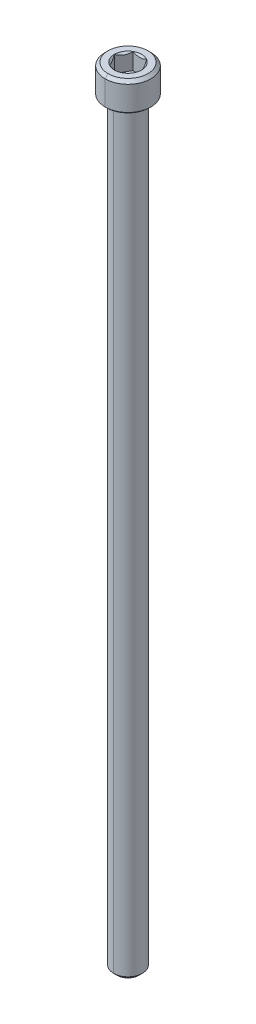
ISO-10303-21;
HEADER;
FILE_DESCRIPTION(('STEP AP214'),'2;1');
FILE_NAME('part.step','',(''),(''),'','','');
FILE_SCHEMA(('AUTOMOTIVE_DESIGN { 1 0 10303 214 1 1 1 1 }'));
ENDSEC;
DATA;
#1=APPLICATION_CONTEXT('core data for automotive mechanical design processes');
#2=APPLICATION_PROTOCOL_DEFINITION('international standard','automotive_design',2000,#1);
#3=PRODUCT_CONTEXT('',#1,'mechanical');
#4=PRODUCT('Part','Part','',(#3));
#5=PRODUCT_RELATED_PRODUCT_CATEGORY('part','',(#4));
#6=PRODUCT_DEFINITION_FORMATION('','',#4);
#7=PRODUCT_DEFINITION_CONTEXT('part definition',#1,'design');
#8=PRODUCT_DEFINITION('design','',#6,#7);
#9=PRODUCT_DEFINITION_SHAPE('','',#8);
#10=(LENGTH_UNIT() NAMED_UNIT(*) SI_UNIT(.MILLI.,.METRE.));
#11=(NAMED_UNIT(*) PLANE_ANGLE_UNIT() SI_UNIT($,.RADIAN.));
#12=(NAMED_UNIT(*) SI_UNIT($,.STERADIAN.) SOLID_ANGLE_UNIT());
#13=UNCERTAINTY_MEASURE_WITH_UNIT(LENGTH_MEASURE(1.E-05),#10,'distance_accuracy_value','');
#14=(GEOMETRIC_REPRESENTATION_CONTEXT(3) GLOBAL_UNCERTAINTY_ASSIGNED_CONTEXT((#13)) GLOBAL_UNIT_ASSIGNED_CONTEXT((#10,
#11,#12)) REPRESENTATION_CONTEXT('',''));
#15=CARTESIAN_POINT('',(0.,0.,0.));
#16=DIRECTION('',(0.,0.,1.));
#17=DIRECTION('',(1.,0.,0.));
#18=AXIS2_PLACEMENT_3D('',#15,#16,#17);
#19=CARTESIAN_POINT('',(0.,-0.152399999999997,0.));
#20=DIRECTION('',(0.,1.,0.));
#21=DIRECTION('',(0.,0.,1.));
#22=AXIS2_PLACEMENT_3D('',#19,#20,#21);
#23=TOROIDAL_SURFACE('',#22,2.5654,0.1524);
#24=CARTESIAN_POINT('',(0.,-0.152399999999997,-2.5654));
#25=DIRECTION('',(1.,0.,0.));
#26=DIRECTION('',(0.,0.,-1.));
#27=AXIS2_PLACEMENT_3D('',#24,#25,#26);
#28=CIRCLE('',#27,0.1524);
#29=CARTESIAN_POINT('',(0.,0.,-2.5654));
#30=VERTEX_POINT('',#29);
#31=CARTESIAN_POINT('',(0.,-0.152399999999997,-2.413));
#32=VERTEX_POINT('',#31);
#33=EDGE_CURVE('E559',#30,#32,#28,.T.);
#34=ORIENTED_EDGE('',*,*,#33,.F.);
#35=CARTESIAN_POINT('',(0.,0.,0.));
#36=DIRECTION('',(0.,1.,0.));
#37=DIRECTION('',(0.,0.,1.));
#38=AXIS2_PLACEMENT_3D('',#35,#36,#37);
#39=CIRCLE('',#38,2.5654);
#40=CARTESIAN_POINT('',(0.,0.,2.5654));
#41=VERTEX_POINT('',#40);
#42=EDGE_CURVE('E481',#41,#30,#39,.T.);
#43=ORIENTED_EDGE('',*,*,#42,.F.);
#44=CARTESIAN_POINT('',(0.,-0.152399999999997,2.5654));
#45=DIRECTION('',(-1.,0.,0.));
#46=DIRECTION('',(0.,0.,1.));
#47=AXIS2_PLACEMENT_3D('',#44,#45,#46);
#48=CIRCLE('',#47,0.1524);
#49=CARTESIAN_POINT('',(0.,-0.152399999999997,2.413));
#50=VERTEX_POINT('',#49);
#51=EDGE_CURVE('E570',#41,#50,#48,.T.);
#52=ORIENTED_EDGE('',*,*,#51,.T.);
#53=CARTESIAN_POINT('',(0.,-0.152399999999997,0.));
#54=DIRECTION('',(0.,-1.,0.));
#55=DIRECTION('',(0.,0.,1.));
#56=AXIS2_PLACEMENT_3D('',#53,#54,#55);
#57=CIRCLE('',#56,2.413);
#58=EDGE_CURVE('E231',#32,#50,#57,.T.);
#59=ORIENTED_EDGE('',*,*,#58,.F.);
#60=EDGE_LOOP('',(#34,#43,#52,#59));
#61=FACE_BOUND('',#60,.T.);
#62=ADVANCED_FACE('F16',(#61),#23,.F.);
#63=CARTESIAN_POINT('',(2.28769270663697,2.032,0.));
#64=DIRECTION('',(0.866025403784439,0.,-0.5));
#65=DIRECTION('',(0.,-1.,0.));
#66=AXIS2_PLACEMENT_3D('',#63,#64,#65);
#67=PLANE('',#66);
#68=DIRECTION('',(0.,1.,0.));
#69=VECTOR('',#68,1.);
#70=CARTESIAN_POINT('',(2.28769270663697,2.032,0.));
#71=LINE('',#70,#69);
#72=CARTESIAN_POINT('',(2.28769270663697,2.032,0.));
#73=VERTEX_POINT('',#72);
#74=CARTESIAN_POINT('',(2.28769270663697,4.826,0.));
#75=VERTEX_POINT('',#74);
#76=EDGE_CURVE('E11',#73,#75,#71,.T.);
#77=ORIENTED_EDGE('',*,*,#76,.T.);
#78=CARTESIAN_POINT('',(2.28769270663697,4.826,0.));
#79=CARTESIAN_POINT('',(2.14317957440595,4.68148686776898,-0.250304087385059));
#80=CARTESIAN_POINT('',(2.01227876614631,4.6063557329633,-0.477030938042588));
#81=CARTESIAN_POINT('',(1.86218187125153,4.52020691391333,-0.737006386058674));
#82=CARTESIAN_POINT('',(1.71787595811445,4.51951177250135,-0.986951559444716));
#83=CARTESIAN_POINT('',(1.5738329827954,4.51881789769698,-1.23644131117069));
#84=CARTESIAN_POINT('',(1.42308868167617,4.6041731544126,-1.49753809966066));
#85=CARTESIAN_POINT('',(1.29072619033411,4.67912016298365,-1.7267966596815));
#86=CARTESIAN_POINT('',(1.14384635331849,4.826,-1.9812));
#87=B_SPLINE_CURVE_WITH_KNOTS('',2,(#78,#79,#80,#81,#82,#83,#84,#85,#86),.UNSPECIFIED.,.F.,.F.,
(3,2,2,2,3),(0.,0.25,0.5,0.75,1.),.UNSPECIFIED.);
#88=CARTESIAN_POINT('',(1.14384635331849,4.826,-1.9812));
#89=VERTEX_POINT('',#88);
#90=EDGE_CURVE('E199',#75,#89,#87,.T.);
#91=ORIENTED_EDGE('',*,*,#90,.T.);
#92=DIRECTION('',(0.,1.,0.));
#93=VECTOR('',#92,1.);
#94=CARTESIAN_POINT('',(1.14384635331849,2.032,-1.9812));
#95=LINE('',#94,#93);
#96=CARTESIAN_POINT('',(1.14384635331849,2.032,-1.9812));
#97=VERTEX_POINT('',#96);
#98=EDGE_CURVE('E170',#97,#89,#95,.T.);
#99=ORIENTED_EDGE('',*,*,#98,.F.);
#100=DIRECTION('',(-0.5,0.,-0.866025403784439));
#101=VECTOR('',#100,1.);
#102=CARTESIAN_POINT('',(2.28769270663697,2.032,0.));
#103=LINE('',#102,#101);
#104=EDGE_CURVE('E191',#73,#97,#103,.T.);
#105=ORIENTED_EDGE('',*,*,#104,.F.);
#106=EDGE_LOOP('',(#77,#91,#99,#105));
#107=FACE_BOUND('',#106,.T.);
#108=ADVANCED_FACE('F196',(#107),#67,.F.);
#109=CARTESIAN_POINT('',(1.14384635331849,2.032,1.9812));
#110=DIRECTION('',(0.866025403784439,0.,0.5));
#111=DIRECTION('',(0.,-1.,0.));
#112=AXIS2_PLACEMENT_3D('',#109,#110,#111);
#113=PLANE('',#112);
#114=DIRECTION('',(0.,1.,0.));
#115=VECTOR('',#114,1.);
#116=CARTESIAN_POINT('',(1.14384635331849,2.032,1.9812));
#117=LINE('',#116,#115);
#118=CARTESIAN_POINT('',(1.14384635331849,2.032,1.9812));
#119=VERTEX_POINT('',#118);
#120=CARTESIAN_POINT('',(1.14384635331849,4.826,1.9812));
#121=VERTEX_POINT('',#120);
#122=EDGE_CURVE('E30',#119,#121,#117,.T.);
#123=ORIENTED_EDGE('',*,*,#122,.T.);
#124=CARTESIAN_POINT('',(1.14384635331849,4.826,1.9812));
#125=CARTESIAN_POINT('',(1.28835948554838,4.6814868677701,1.7308959126169));
#126=CARTESIAN_POINT('',(1.41926029380915,4.60635573296329,1.50416906195741));
#127=CARTESIAN_POINT('',(1.56935718870215,4.5202069139138,1.24419361394442));
#128=CARTESIAN_POINT('',(1.71366310184101,4.51951177250135,0.994248440555283));
#129=CARTESIAN_POINT('',(1.85770607715928,4.51881789769651,0.744758688830662));
#130=CARTESIAN_POINT('',(2.00845037827929,4.6041731544126,0.48366190033934));
#131=CARTESIAN_POINT('',(2.14081286962138,4.67912016298368,0.254403340318435));
#132=CARTESIAN_POINT('',(2.28769270663697,4.826,0.));
#133=B_SPLINE_CURVE_WITH_KNOTS('',2,(#124,#125,#126,#127,#128,#129,#130,#131,#132),
.UNSPECIFIED.,.F.,.F.,(3,2,2,2,3),(0.,0.25,0.5,0.75,1.),.UNSPECIFIED.);
#134=EDGE_CURVE('E183',#121,#75,#133,.T.);
#135=ORIENTED_EDGE('',*,*,#134,.T.);
#136=ORIENTED_EDGE('',*,*,#76,.F.);
#137=DIRECTION('',(0.5,0.,-0.866025403784439));
#138=VECTOR('',#137,1.);
#139=CARTESIAN_POINT('',(1.14384635331849,2.032,1.9812));
#140=LINE('',#139,#138);
#141=EDGE_CURVE('E180',#119,#73,#140,.T.);
#142=ORIENTED_EDGE('',*,*,#141,.F.);
#143=EDGE_LOOP('',(#123,#135,#136,#142));
#144=FACE_BOUND('',#143,.T.);
#145=ADVANCED_FACE('F179',(#144),#113,.F.);
#146=CARTESIAN_POINT('',(-1.14384635331848,2.032,1.9812));
#147=DIRECTION('',(0.,0.,1.));
#148=DIRECTION('',(1.,0.,0.));
#149=AXIS2_PLACEMENT_3D('',#146,#147,#148);
#150=PLANE('',#149);
#151=DIRECTION('',(0.,1.,0.));
#152=VECTOR('',#151,1.);
#153=CARTESIAN_POINT('',(-1.14384635331848,2.032,1.9812));
#154=LINE('',#153,#152);
#155=CARTESIAN_POINT('',(-1.14384635331848,2.032,1.9812));
#156=VERTEX_POINT('',#155);
#157=CARTESIAN_POINT('',(-1.14384635331848,4.826,1.9812));
#158=VERTEX_POINT('',#157);
#159=EDGE_CURVE('E413',#156,#158,#154,.T.);
#160=ORIENTED_EDGE('',*,*,#159,.T.);
#161=CARTESIAN_POINT('',(-1.14384635331848,4.826,1.9812));
#162=CARTESIAN_POINT('',(-0.852604529161856,4.68037908792168,1.9812));
#163=CARTESIAN_POINT('',(-0.58892975472875,4.6051869937822,1.9812));
#164=CARTESIAN_POINT('',(-0.288478278545423,4.51950729336303,1.9812));
#165=CARTESIAN_POINT('',(0.,4.51950729336303,1.9812));
#166=B_SPLINE_CURVE_WITH_KNOTS('',2,(#161,#162,#163,#164,#165),.UNSPECIFIED.,.F.,.F.,(3,2,3),
(0.,0.5,1.),.UNSPECIFIED.);
#167=CARTESIAN_POINT('',(0.,4.51950729336303,1.9812));
#168=VERTEX_POINT('',#167);
#169=EDGE_CURVE('E408',#158,#168,#166,.T.);
#170=ORIENTED_EDGE('',*,*,#169,.T.);
#171=CARTESIAN_POINT('',(0.,4.51950729336303,1.9812));
#172=CARTESIAN_POINT('',(0.287946815411568,4.51950729336303,1.9812));
#173=CARTESIAN_POINT('',(0.588849780232636,4.60516420753973,1.9812));
#174=CARTESIAN_POINT('',(0.851987770474281,4.68007070857789,1.9812));
#175=CARTESIAN_POINT('',(1.14384635331849,4.826,1.9812));
#176=B_SPLINE_CURVE_WITH_KNOTS('',2,(#171,#172,#173,#174,#175),.UNSPECIFIED.,.F.,.F.,(3,2,3),
(0.,0.5,1.),.UNSPECIFIED.);
#177=EDGE_CURVE('E377',#168,#121,#176,.T.);
#178=ORIENTED_EDGE('',*,*,#177,.T.);
#179=ORIENTED_EDGE('',*,*,#122,.F.);
#180=DIRECTION('',(1.,0.,0.));
#181=VECTOR('',#180,1.);
#182=CARTESIAN_POINT('',(-1.14384635331848,2.032,1.9812));
#183=LINE('',#182,#181);
#184=EDGE_CURVE('E193',#156,#119,#183,.T.);
#185=ORIENTED_EDGE('',*,*,#184,.F.);
#186=EDGE_LOOP('',(#160,#170,#178,#179,#185));
#187=FACE_BOUND('',#186,.T.);
#188=ADVANCED_FACE('F381',(#187),#150,.F.);
#189=CARTESIAN_POINT('',(-2.28769270663697,2.032,0.));
#190=DIRECTION('',(-0.866025403784438,0.,0.5));
#191=DIRECTION('',(0.,1.,0.));
#192=AXIS2_PLACEMENT_3D('',#189,#190,#191);
#193=PLANE('',#192);
#194=DIRECTION('',(0.,1.,0.));
#195=VECTOR('',#194,1.);
#196=CARTESIAN_POINT('',(-2.28769270663697,2.032,0.));
#197=LINE('',#196,#195);
#198=CARTESIAN_POINT('',(-2.28769270663697,2.032,0.));
#199=VERTEX_POINT('',#198);
#200=CARTESIAN_POINT('',(-2.28769270663697,4.826,0.));
#201=VERTEX_POINT('',#200);
#202=EDGE_CURVE('E421',#199,#201,#197,.T.);
#203=ORIENTED_EDGE('',*,*,#202,.T.);
#204=CARTESIAN_POINT('',(-2.28769270663697,4.826,0.));
#205=CARTESIAN_POINT('',(-2.14317957440604,4.68148686776907,0.250304087384906));
#206=CARTESIAN_POINT('',(-2.01227876614631,4.6063557329633,0.477030938042588));
#207=CARTESIAN_POINT('',(-1.8621818712512,4.5202069139131,0.737006386059238));
#208=CARTESIAN_POINT('',(-1.71787595811445,4.51951177250135,0.986951559444715));
#209=CARTESIAN_POINT('',(-1.57383298279637,4.51881789769721,1.23644131116902));
#210=CARTESIAN_POINT('',(-1.42308868167617,4.6041731544126,1.49753809966066));
#211=CARTESIAN_POINT('',(-1.2907261903357,4.67912016298207,1.72679665967875));
#212=CARTESIAN_POINT('',(-1.14384635331849,4.826,1.9812));
#213=B_SPLINE_CURVE_WITH_KNOTS('',2,(#204,#205,#206,#207,#208,#209,#210,#211,#212),
.UNSPECIFIED.,.F.,.F.,(3,2,2,2,3),(0.,0.25,0.5,0.75,1.),.UNSPECIFIED.);
#214=EDGE_CURVE('E446',#201,#158,#213,.T.);
#215=ORIENTED_EDGE('',*,*,#214,.T.);
#216=ORIENTED_EDGE('',*,*,#159,.F.);
#217=DIRECTION('',(0.5,0.,0.866025403784439));
#218=VECTOR('',#217,1.);
#219=CARTESIAN_POINT('',(-2.28769270663697,2.032,0.));
#220=LINE('',#219,#218);
#221=EDGE_CURVE('E234',#199,#156,#220,.T.);
#222=ORIENTED_EDGE('',*,*,#221,.F.);
#223=EDGE_LOOP('',(#203,#215,#216,#222));
#224=FACE_BOUND('',#223,.T.);
#225=ADVANCED_FACE('F312',(#224),#193,.F.);
#226=CARTESIAN_POINT('',(-1.14384635331849,2.032,-1.9812));
#227=DIRECTION('',(-0.866025403784439,0.,-0.5));
#228=DIRECTION('',(-0.5,0.,0.866025403784439));
#229=AXIS2_PLACEMENT_3D('',#226,#227,#228);
#230=PLANE('',#229);
#231=DIRECTION('',(0.,1.,0.));
#232=VECTOR('',#231,1.);
#233=CARTESIAN_POINT('',(-1.14384635331849,2.032,-1.9812));
#234=LINE('',#233,#232);
#235=CARTESIAN_POINT('',(-1.14384635331849,2.032,-1.9812));
#236=VERTEX_POINT('',#235);
#237=CARTESIAN_POINT('',(-1.14384635331849,4.826,-1.9812));
#238=VERTEX_POINT('',#237);
#239=EDGE_CURVE('E339',#236,#238,#234,.T.);
#240=ORIENTED_EDGE('',*,*,#239,.T.);
#241=CARTESIAN_POINT('',(-1.14384635331849,4.826,-1.9812));
#242=CARTESIAN_POINT('',(-1.28835948554886,4.68148686776963,-1.73089591261607));
#243=CARTESIAN_POINT('',(-1.41926029380915,4.6063557329633,-1.50416906195741));
#244=CARTESIAN_POINT('',(-1.56935718870378,4.5202069139131,-1.24419361394159));
#245=CARTESIAN_POINT('',(-1.71366310184101,4.51951177250136,-0.994248440555283));
#246=CARTESIAN_POINT('',(-1.85770607715962,4.51881789769721,-0.744758688830066));
#247=CARTESIAN_POINT('',(-2.00845037827929,4.6041731544126,-0.48366190033934));
#248=CARTESIAN_POINT('',(-2.14081286962037,4.67912016298268,-0.254403340320189));
#249=CARTESIAN_POINT('',(-2.28769270663697,4.826,0.));
#250=B_SPLINE_CURVE_WITH_KNOTS('',2,(#241,#242,#243,#244,#245,#246,#247,#248,#249),
.UNSPECIFIED.,.F.,.F.,(3,2,2,2,3),(0.,0.25,0.5,0.75,1.),.UNSPECIFIED.);
#251=EDGE_CURVE('E333',#238,#201,#250,.T.);
#252=ORIENTED_EDGE('',*,*,#251,.T.);
#253=ORIENTED_EDGE('',*,*,#202,.F.);
#254=DIRECTION('',(-0.5,0.,0.866025403784439));
#255=VECTOR('',#254,1.);
#256=CARTESIAN_POINT('',(-1.14384635331849,2.032,-1.9812));
#257=LINE('',#256,#255);
#258=EDGE_CURVE('E206',#236,#199,#257,.T.);
#259=ORIENTED_EDGE('',*,*,#258,.F.);
#260=EDGE_LOOP('',(#240,#252,#253,#259));
#261=FACE_BOUND('',#260,.T.);
#262=ADVANCED_FACE('F307',(#261),#230,.F.);
#263=CARTESIAN_POINT('',(1.14384635331849,2.032,-1.9812));
#264=DIRECTION('',(0.,0.,-1.));
#265=DIRECTION('',(0.,-1.,0.));
#266=AXIS2_PLACEMENT_3D('',#263,#264,#265);
#267=PLANE('',#266);
#268=ORIENTED_EDGE('',*,*,#98,.T.);
#269=CARTESIAN_POINT('',(1.14384635331849,4.826,-1.9812));
#270=CARTESIAN_POINT('',(0.852681268449242,4.68041745756538,-1.9812));
#271=CARTESIAN_POINT('',(0.589071853179802,4.60522748732522,-1.9812));
#272=CARTESIAN_POINT('',(0.289065178881829,4.51965583621686,-1.9812));
#273=CARTESIAN_POINT('',(0.000466056341207922,4.51950734818044,-1.9812));
#274=CARTESIAN_POINT('',(-0.28735920168427,4.51935925830747,-1.9812));
#275=CARTESIAN_POINT('',(-0.588708500274589,4.60512396116295,-1.9812));
#276=CARTESIAN_POINT('',(-0.851909486810259,4.68003156674588,-1.9812));
#277=CARTESIAN_POINT('',(-1.14384635331849,4.826,-1.9812));
#278=B_SPLINE_CURVE_WITH_KNOTS('',2,(#269,#270,#271,#272,#273,#274,#275,#276,#277),
.UNSPECIFIED.,.F.,.F.,(3,2,2,2,3),(0.,0.25,0.5,0.75,1.),.UNSPECIFIED.);
#279=EDGE_CURVE('E474',#89,#238,#278,.T.);
#280=ORIENTED_EDGE('',*,*,#279,.T.);
#281=ORIENTED_EDGE('',*,*,#239,.F.);
#282=DIRECTION('',(-1.,0.,0.));
#283=VECTOR('',#282,1.);
#284=CARTESIAN_POINT('',(1.14384635331849,2.032,-1.9812));
#285=LINE('',#284,#283);
#286=EDGE_CURVE('E198',#97,#236,#285,.T.);
#287=ORIENTED_EDGE('',*,*,#286,.F.);
#288=EDGE_LOOP('',(#268,#280,#281,#287));
#289=FACE_BOUND('',#288,.T.);
#290=ADVANCED_FACE('F311',(#289),#267,.F.);
#291=CARTESIAN_POINT('',(0.,2.032,0.));
#292=DIRECTION('',(0.,1.,0.));
#293=DIRECTION('',(1.,0.,0.));
#294=AXIS2_PLACEMENT_3D('',#291,#292,#293);
#295=PLANE('',#294);
#296=ORIENTED_EDGE('',*,*,#104,.T.);
#297=ORIENTED_EDGE('',*,*,#286,.T.);
#298=ORIENTED_EDGE('',*,*,#258,.T.);
#299=ORIENTED_EDGE('',*,*,#221,.T.);
#300=ORIENTED_EDGE('',*,*,#184,.T.);
#301=ORIENTED_EDGE('',*,*,#141,.T.);
#302=EDGE_LOOP('',(#296,#297,#298,#299,#300,#301));
#303=FACE_BOUND('',#302,.T.);
#304=ADVANCED_FACE('F189',(#303),#295,.T.);
#305=CARTESIAN_POINT('',(0.,4.826,0.));
#306=DIRECTION('',(0.,1.,0.));
#307=DIRECTION('',(0.,0.,1.));
#308=AXIS2_PLACEMENT_3D('',#305,#306,#307);
#309=CONICAL_SURFACE('',#308,2.28769270663697,0.78539816339745);
#310=CARTESIAN_POINT('',(0.,4.826,0.));
#311=DIRECTION('',(0.,1.,0.));
#312=DIRECTION('',(0.,0.,1.));
#313=AXIS2_PLACEMENT_3D('',#310,#311,#312);
#314=CIRCLE('',#313,2.28769270663697);
#315=EDGE_CURVE('E487',#75,#89,#314,.T.);
#316=ORIENTED_EDGE('',*,*,#315,.T.);
#317=ORIENTED_EDGE('',*,*,#90,.F.);
#318=EDGE_LOOP('',(#316,#317));
#319=FACE_BOUND('',#318,.T.);
#320=ADVANCED_FACE('F314',(#319),#309,.F.);
#321=CARTESIAN_POINT('',(0.,4.826,0.));
#322=DIRECTION('',(0.,1.,0.));
#323=DIRECTION('',(0.,0.,1.));
#324=AXIS2_PLACEMENT_3D('',#321,#322,#323);
#325=CONICAL_SURFACE('',#324,2.28769270663697,0.78539816339745);
#326=CARTESIAN_POINT('',(0.,4.826,0.));
#327=DIRECTION('',(0.,1.,0.));
#328=DIRECTION('',(0.,0.,1.));
#329=AXIS2_PLACEMENT_3D('',#326,#327,#328);
#330=CIRCLE('',#329,2.28769270663697);
#331=EDGE_CURVE('E434',#121,#75,#330,.T.);
#332=ORIENTED_EDGE('',*,*,#331,.T.);
#333=ORIENTED_EDGE('',*,*,#134,.F.);
#334=EDGE_LOOP('',(#332,#333));
#335=FACE_BOUND('',#334,.T.);
#336=ADVANCED_FACE('F914',(#335),#325,.F.);
#337=CARTESIAN_POINT('',(0.,4.826,0.));
#338=DIRECTION('',(0.,1.,0.));
#339=DIRECTION('',(0.,0.,1.));
#340=AXIS2_PLACEMENT_3D('',#337,#338,#339);
#341=CONICAL_SURFACE('',#340,2.28769270663697,0.78539816339745);
#342=DIRECTION('',(0.,0.707106781186546,0.707106781186549));
#343=VECTOR('',#342,1.);
#344=CARTESIAN_POINT('',(0.,4.826,2.28769270663697));
#345=LINE('',#344,#343);
#346=CARTESIAN_POINT('',(0.,4.826,2.28769270663697));
#347=VERTEX_POINT('',#346);
#348=EDGE_CURVE('E437',#168,#347,#345,.T.);
#349=ORIENTED_EDGE('',*,*,#348,.F.);
#350=ORIENTED_EDGE('',*,*,#169,.F.);
#351=CARTESIAN_POINT('',(0.,4.826,0.));
#352=DIRECTION('',(0.,1.,0.));
#353=DIRECTION('',(0.,0.,1.));
#354=AXIS2_PLACEMENT_3D('',#351,#352,#353);
#355=CIRCLE('',#354,2.28769270663697);
#356=EDGE_CURVE('E429',#158,#347,#355,.T.);
#357=ORIENTED_EDGE('',*,*,#356,.T.);
#358=EDGE_LOOP('',(#349,#350,#357));
#359=FACE_BOUND('',#358,.T.);
#360=ADVANCED_FACE('F18',(#359),#341,.F.);
#361=CARTESIAN_POINT('',(0.,4.826,0.));
#362=DIRECTION('',(0.,1.,0.));
#363=DIRECTION('',(0.,0.,1.));
#364=AXIS2_PLACEMENT_3D('',#361,#362,#363);
#365=CONICAL_SURFACE('',#364,2.28769270663697,0.78539816339745);
#366=CARTESIAN_POINT('',(0.,4.826,0.));
#367=DIRECTION('',(0.,1.,0.));
#368=DIRECTION('',(0.,0.,1.));
#369=AXIS2_PLACEMENT_3D('',#366,#367,#368);
#370=CIRCLE('',#369,2.28769270663697);
#371=EDGE_CURVE('E424',#201,#158,#370,.T.);
#372=ORIENTED_EDGE('',*,*,#371,.T.);
#373=ORIENTED_EDGE('',*,*,#214,.F.);
#374=EDGE_LOOP('',(#372,#373));
#375=FACE_BOUND('',#374,.T.);
#376=ADVANCED_FACE('F352',(#375),#365,.F.);
#377=CARTESIAN_POINT('',(0.,4.826,0.));
#378=DIRECTION('',(0.,1.,0.));
#379=DIRECTION('',(0.,0.,1.));
#380=AXIS2_PLACEMENT_3D('',#377,#378,#379);
#381=CONICAL_SURFACE('',#380,2.28769270663697,0.78539816339745);
#382=CARTESIAN_POINT('',(0.,4.826,0.));
#383=DIRECTION('',(0.,1.,0.));
#384=DIRECTION('',(0.,0.,1.));
#385=AXIS2_PLACEMENT_3D('',#382,#383,#384);
#386=CIRCLE('',#385,2.28769270663697);
#387=EDGE_CURVE('E428',#238,#201,#386,.T.);
#388=ORIENTED_EDGE('',*,*,#387,.T.);
#389=ORIENTED_EDGE('',*,*,#251,.F.);
#390=EDGE_LOOP('',(#388,#389));
#391=FACE_BOUND('',#390,.T.);
#392=ADVANCED_FACE('F341',(#391),#381,.F.);
#393=CARTESIAN_POINT('',(0.,4.826,0.));
#394=DIRECTION('',(0.,1.,0.));
#395=DIRECTION('',(0.,0.,1.));
#396=AXIS2_PLACEMENT_3D('',#393,#394,#395);
#397=CONICAL_SURFACE('',#396,2.28769270663697,0.78539816339745);
#398=CARTESIAN_POINT('',(0.,4.826,0.));
#399=DIRECTION('',(0.,1.,0.));
#400=DIRECTION('',(0.,0.,1.));
#401=AXIS2_PLACEMENT_3D('',#398,#399,#400);
#402=CIRCLE('',#401,2.28769270663697);
#403=EDGE_CURVE('E483',#89,#238,#402,.T.);
#404=ORIENTED_EDGE('',*,*,#403,.T.);
#405=ORIENTED_EDGE('',*,*,#279,.F.);
#406=EDGE_LOOP('',(#404,#405));
#407=FACE_BOUND('',#406,.T.);
#408=ADVANCED_FACE('F351',(#407),#397,.F.);
#409=CARTESIAN_POINT('',(0.,0.228600000000006,0.));
#410=DIRECTION('',(0.,1.,0.));
#411=DIRECTION('',(0.,0.,1.));
#412=AXIS2_PLACEMENT_3D('',#409,#410,#411);
#413=CONICAL_SURFACE('',#412,3.8354,0.785398163397448);
#414=DIRECTION('',(0.,0.707106781186548,-0.707106781186547));
#415=VECTOR('',#414,1.);
#416=CARTESIAN_POINT('',(0.,0.228600000000006,-3.8354));
#417=LINE('',#416,#415);
#418=CARTESIAN_POINT('',(0.,0.,-3.6068));
#419=VERTEX_POINT('',#418);
#420=CARTESIAN_POINT('',(0.,0.228600000000006,-3.8354));
#421=VERTEX_POINT('',#420);
#422=EDGE_CURVE('E241',#419,#421,#417,.T.);
#423=ORIENTED_EDGE('',*,*,#422,.F.);
#424=CARTESIAN_POINT('',(0.,0.,0.));
#425=DIRECTION('',(0.,-1.,0.));
#426=DIRECTION('',(0.,0.,1.));
#427=AXIS2_PLACEMENT_3D('',#424,#425,#426);
#428=CIRCLE('',#427,3.6068);
#429=CARTESIAN_POINT('',(0.,0.,3.6068));
#430=VERTEX_POINT('',#429);
#431=EDGE_CURVE('E610',#430,#419,#428,.T.);
#432=ORIENTED_EDGE('',*,*,#431,.F.);
#433=DIRECTION('',(0.,0.707106781186548,0.707106781186547));
#434=VECTOR('',#433,1.);
#435=CARTESIAN_POINT('',(0.,0.228600000000006,3.8354));
#436=LINE('',#435,#434);
#437=CARTESIAN_POINT('',(0.,0.228600000000006,3.8354));
#438=VERTEX_POINT('',#437);
#439=EDGE_CURVE('E240',#430,#438,#436,.T.);
#440=ORIENTED_EDGE('',*,*,#439,.T.);
#441=CARTESIAN_POINT('',(0.,0.228600000000006,0.));
#442=DIRECTION('',(0.,1.,0.));
#443=DIRECTION('',(0.,0.,1.));
#444=AXIS2_PLACEMENT_3D('',#441,#442,#443);
#445=CIRCLE('',#444,3.8354);
#446=EDGE_CURVE('E214',#421,#438,#445,.T.);
#447=ORIENTED_EDGE('',*,*,#446,.F.);
#448=EDGE_LOOP('',(#423,#432,#440,#447));
#449=FACE_BOUND('',#448,.T.);
#450=ADVANCED_FACE('F300',(#449),#413,.T.);
#451=CARTESIAN_POINT('',(0.,4.826,0.));
#452=DIRECTION('',(0.,-1.,0.));
#453=DIRECTION('',(0.,0.,-1.));
#454=AXIS2_PLACEMENT_3D('',#451,#452,#453);
#455=CONICAL_SURFACE('',#454,3.3354,0.785398163397463);
#456=DIRECTION('',(0.,-0.707106781186537,0.707106781186558));
#457=VECTOR('',#456,1.);
#458=CARTESIAN_POINT('',(0.,4.826,3.3354));
#459=LINE('',#458,#457);
#460=CARTESIAN_POINT('',(0.,4.826,3.3354));
#461=VERTEX_POINT('',#460);
#462=CARTESIAN_POINT('',(0.,4.326,3.8354));
#463=VERTEX_POINT('',#462);
#464=EDGE_CURVE('E239',#461,#463,#459,.T.);
#465=ORIENTED_EDGE('',*,*,#464,.F.);
#466=CARTESIAN_POINT('',(0.,4.826,0.));
#467=DIRECTION('',(0.,1.,0.));
#468=DIRECTION('',(0.,0.,1.));
#469=AXIS2_PLACEMENT_3D('',#466,#467,#468);
#470=CIRCLE('',#469,3.3354);
#471=CARTESIAN_POINT('',(0.,4.826,-3.3354));
#472=VERTEX_POINT('',#471);
#473=EDGE_CURVE('E264',#472,#461,#470,.T.);
#474=ORIENTED_EDGE('',*,*,#473,.F.);
#475=DIRECTION('',(0.,-0.707106781186537,-0.707106781186558));
#476=VECTOR('',#475,1.);
#477=CARTESIAN_POINT('',(0.,4.826,-3.3354));
#478=LINE('',#477,#476);
#479=CARTESIAN_POINT('',(0.,4.326,-3.8354));
#480=VERTEX_POINT('',#479);
#481=EDGE_CURVE('E579',#472,#480,#478,.T.);
#482=ORIENTED_EDGE('',*,*,#481,.T.);
#483=CARTESIAN_POINT('',(0.,4.326,0.));
#484=DIRECTION('',(0.,-1.,0.));
#485=DIRECTION('',(0.,0.,1.));
#486=AXIS2_PLACEMENT_3D('',#483,#484,#485);
#487=CIRCLE('',#486,3.8354);
#488=EDGE_CURVE('E87',#463,#480,#487,.T.);
#489=ORIENTED_EDGE('',*,*,#488,.F.);
#490=EDGE_LOOP('',(#465,#474,#482,#489));
#491=FACE_BOUND('',#490,.T.);
#492=ADVANCED_FACE('F296',(#491),#455,.T.);
#493=CARTESIAN_POINT('',(0.,0.,0.));
#494=DIRECTION('',(0.,1.,0.));
#495=DIRECTION('',(1.,0.,0.));
#496=AXIS2_PLACEMENT_3D('',#493,#494,#495);
#497=PLANE('',#496);
#498=ORIENTED_EDGE('',*,*,#42,.T.);
#499=CARTESIAN_POINT('',(0.,0.,0.));
#500=DIRECTION('',(0.,1.,0.));
#501=DIRECTION('',(0.,0.,1.));
#502=AXIS2_PLACEMENT_3D('',#499,#500,#501);
#503=CIRCLE('',#502,2.5654);
#504=EDGE_CURVE('E567',#30,#41,#503,.T.);
#505=ORIENTED_EDGE('',*,*,#504,.T.);
#506=EDGE_LOOP('',(#498,#505));
#507=FACE_BOUND('',#506,.T.);
#508=ORIENTED_EDGE('',*,*,#431,.T.);
#509=CARTESIAN_POINT('',(0.,0.,0.));
#510=DIRECTION('',(0.,-1.,0.));
#511=DIRECTION('',(0.,0.,1.));
#512=AXIS2_PLACEMENT_3D('',#509,#510,#511);
#513=CIRCLE('',#512,3.6068);
#514=EDGE_CURVE('E246',#419,#430,#513,.T.);
#515=ORIENTED_EDGE('',*,*,#514,.T.);
#516=EDGE_LOOP('',(#508,#515));
#517=FACE_BOUND('',#516,.T.);
#518=ADVANCED_FACE('F299',(#507,#517),#497,.F.);
#519=CARTESIAN_POINT('',(0.,4.826,0.));
#520=DIRECTION('',(0.,1.,0.));
#521=DIRECTION('',(1.,0.,0.));
#522=AXIS2_PLACEMENT_3D('',#519,#520,#521);
#523=PLANE('',#522);
#524=ORIENTED_EDGE('',*,*,#331,.F.);
#525=CARTESIAN_POINT('',(0.,4.826,0.));
#526=DIRECTION('',(0.,1.,0.));
#527=DIRECTION('',(0.,0.,1.));
#528=AXIS2_PLACEMENT_3D('',#525,#526,#527);
#529=CIRCLE('',#528,2.28769270663697);
#530=EDGE_CURVE('E258',#347,#121,#529,.T.);
#531=ORIENTED_EDGE('',*,*,#530,.F.);
#532=ORIENTED_EDGE('',*,*,#356,.F.);
#533=ORIENTED_EDGE('',*,*,#371,.F.);
#534=ORIENTED_EDGE('',*,*,#387,.F.);
#535=ORIENTED_EDGE('',*,*,#403,.F.);
#536=ORIENTED_EDGE('',*,*,#315,.F.);
#537=EDGE_LOOP('',(#524,#531,#532,#533,#534,#535,#536));
#538=FACE_BOUND('',#537,.T.);
#539=ORIENTED_EDGE('',*,*,#473,.T.);
#540=CARTESIAN_POINT('',(0.,4.826,0.));
#541=DIRECTION('',(0.,1.,0.));
#542=DIRECTION('',(0.,0.,1.));
#543=AXIS2_PLACEMENT_3D('',#540,#541,#542);
#544=CIRCLE('',#543,3.3354);
#545=EDGE_CURVE('E235',#461,#472,#544,.T.);
#546=ORIENTED_EDGE('',*,*,#545,.T.);
#547=EDGE_LOOP('',(#539,#546));
#548=FACE_BOUND('',#547,.T.);
#549=ADVANCED_FACE('F289',(#538,#548),#523,.T.);
#550=CARTESIAN_POINT('',(0.,4.826,0.));
#551=DIRECTION('',(0.,-1.,0.));
#552=DIRECTION('',(0.,0.,-1.));
#553=AXIS2_PLACEMENT_3D('',#550,#551,#552);
#554=CYLINDRICAL_SURFACE('',#553,3.8354);
#555=DIRECTION('',(0.,-1.,0.));
#556=VECTOR('',#555,1.);
#557=CARTESIAN_POINT('',(0.,4.826,3.8354));
#558=LINE('',#557,#556);
#559=EDGE_CURVE('E210',#463,#438,#558,.T.);
#560=ORIENTED_EDGE('',*,*,#559,.F.);
#561=ORIENTED_EDGE('',*,*,#488,.T.);
#562=DIRECTION('',(0.,-1.,0.));
#563=VECTOR('',#562,1.);
#564=CARTESIAN_POINT('',(0.,4.826,-3.8354));
#565=LINE('',#564,#563);
#566=EDGE_CURVE('E227',#480,#421,#565,.T.);
#567=ORIENTED_EDGE('',*,*,#566,.T.);
#568=ORIENTED_EDGE('',*,*,#446,.T.);
#569=EDGE_LOOP('',(#560,#561,#567,#568));
#570=FACE_BOUND('',#569,.T.);
#571=ADVANCED_FACE('F285',(#570),#554,.T.);
#572=CARTESIAN_POINT('',(0.,-126.4158,0.));
#573=DIRECTION('',(0.,1.,0.));
#574=DIRECTION('',(0.,0.,1.));
#575=AXIS2_PLACEMENT_3D('',#572,#573,#574);
#576=CONICAL_SURFACE('',#575,2.413,0.785398163397449);
#577=DIRECTION('',(0.,0.707106781186547,-0.707106781186548));
#578=VECTOR('',#577,1.);
#579=CARTESIAN_POINT('',(0.,-126.4158,-2.413));
#580=LINE('',#579,#578);
#581=CARTESIAN_POINT('',(0.,-127.,-1.8288));
#582=VERTEX_POINT('',#581);
#583=CARTESIAN_POINT('',(0.,-126.4158,-2.413));
#584=VERTEX_POINT('',#583);
#585=EDGE_CURVE('E226',#582,#584,#580,.T.);
#586=ORIENTED_EDGE('',*,*,#585,.F.);
#587=CARTESIAN_POINT('',(0.,-127.,0.));
#588=DIRECTION('',(0.,-1.,0.));
#589=DIRECTION('',(0.,0.,1.));
#590=AXIS2_PLACEMENT_3D('',#587,#588,#589);
#591=CIRCLE('',#590,1.8288);
#592=CARTESIAN_POINT('',(0.,-127.,1.8288));
#593=VERTEX_POINT('',#592);
#594=EDGE_CURVE('E215',#593,#582,#591,.T.);
#595=ORIENTED_EDGE('',*,*,#594,.F.);
#596=DIRECTION('',(0.,0.707106781186547,0.707106781186548));
#597=VECTOR('',#596,1.);
#598=CARTESIAN_POINT('',(0.,-126.4158,2.413));
#599=LINE('',#598,#597);
#600=CARTESIAN_POINT('',(0.,-126.4158,2.413));
#601=VERTEX_POINT('',#600);
#602=EDGE_CURVE('E216',#593,#601,#599,.T.);
#603=ORIENTED_EDGE('',*,*,#602,.T.);
#604=CARTESIAN_POINT('',(0.,-126.4158,0.));
#605=DIRECTION('',(0.,1.,0.));
#606=DIRECTION('',(0.,0.,1.));
#607=AXIS2_PLACEMENT_3D('',#604,#605,#606);
#608=CIRCLE('',#607,2.413);
#609=EDGE_CURVE('E252',#584,#601,#608,.T.);
#610=ORIENTED_EDGE('',*,*,#609,.F.);
#611=EDGE_LOOP('',(#586,#595,#603,#610));
#612=FACE_BOUND('',#611,.T.);
#613=ADVANCED_FACE('F288',(#612),#576,.T.);
#614=CARTESIAN_POINT('',(0.,-127.,0.));
#615=DIRECTION('',(0.,1.,0.));
#616=DIRECTION('',(1.,0.,0.));
#617=AXIS2_PLACEMENT_3D('',#614,#615,#616);
#618=PLANE('',#617);
#619=ORIENTED_EDGE('',*,*,#594,.T.);
#620=CARTESIAN_POINT('',(0.,-127.,0.));
#621=DIRECTION('',(0.,-1.,0.));
#622=DIRECTION('',(0.,0.,1.));
#623=AXIS2_PLACEMENT_3D('',#620,#621,#622);
#624=CIRCLE('',#623,1.8288);
#625=EDGE_CURVE('E222',#582,#593,#624,.T.);
#626=ORIENTED_EDGE('',*,*,#625,.T.);
#627=EDGE_LOOP('',(#619,#626));
#628=FACE_BOUND('',#627,.T.);
#629=ADVANCED_FACE('F294',(#628),#618,.F.);
#630=CARTESIAN_POINT('',(0.,-127.,0.));
#631=DIRECTION('',(0.,1.,0.));
#632=DIRECTION('',(0.,0.,1.));
#633=AXIS2_PLACEMENT_3D('',#630,#631,#632);
#634=CYLINDRICAL_SURFACE('',#633,2.413);
#635=DIRECTION('',(0.,1.,0.));
#636=VECTOR('',#635,1.);
#637=CARTESIAN_POINT('',(0.,-127.,-2.413));
#638=LINE('',#637,#636);
#639=EDGE_CURVE('E220',#584,#32,#638,.T.);
#640=ORIENTED_EDGE('',*,*,#639,.F.);
#641=ORIENTED_EDGE('',*,*,#609,.T.);
#642=DIRECTION('',(0.,1.,0.));
#643=VECTOR('',#642,1.);
#644=CARTESIAN_POINT('',(0.,-127.,2.413));
#645=LINE('',#644,#643);
#646=EDGE_CURVE('E261',#601,#50,#645,.T.);
#647=ORIENTED_EDGE('',*,*,#646,.T.);
#648=CARTESIAN_POINT('',(0.,-0.152399999999997,0.));
#649=DIRECTION('',(0.,-1.,0.));
#650=DIRECTION('',(0.,0.,1.));
#651=AXIS2_PLACEMENT_3D('',#648,#649,#650);
#652=CIRCLE('',#651,2.413);
#653=EDGE_CURVE('E566',#50,#32,#652,.T.);
#654=ORIENTED_EDGE('',*,*,#653,.T.);
#655=EDGE_LOOP('',(#640,#641,#647,#654));
#656=FACE_BOUND('',#655,.T.);
#657=ADVANCED_FACE('F290',(#656),#634,.T.);
#658=CARTESIAN_POINT('',(0.,-127.,0.));
#659=DIRECTION('',(0.,1.,0.));
#660=DIRECTION('',(0.,0.,1.));
#661=AXIS2_PLACEMENT_3D('',#658,#659,#660);
#662=CYLINDRICAL_SURFACE('',#661,2.413);
#663=CARTESIAN_POINT('',(0.,-126.4158,0.));
#664=DIRECTION('',(0.,1.,0.));
#665=DIRECTION('',(0.,0.,1.));
#666=AXIS2_PLACEMENT_3D('',#663,#664,#665);
#667=CIRCLE('',#666,2.413);
#668=EDGE_CURVE('E221',#601,#584,#667,.T.);
#669=ORIENTED_EDGE('',*,*,#668,.T.);
#670=ORIENTED_EDGE('',*,*,#639,.T.);
#671=ORIENTED_EDGE('',*,*,#58,.T.);
#672=ORIENTED_EDGE('',*,*,#646,.F.);
#673=EDGE_LOOP('',(#669,#670,#671,#672));
#674=FACE_BOUND('',#673,.T.);
#675=ADVANCED_FACE('F293',(#674),#662,.T.);
#676=CARTESIAN_POINT('',(0.,-126.4158,0.));
#677=DIRECTION('',(0.,1.,0.));
#678=DIRECTION('',(0.,0.,1.));
#679=AXIS2_PLACEMENT_3D('',#676,#677,#678);
#680=CONICAL_SURFACE('',#679,2.413,0.785398163397449);
#681=ORIENTED_EDGE('',*,*,#625,.F.);
#682=ORIENTED_EDGE('',*,*,#585,.T.);
#683=ORIENTED_EDGE('',*,*,#668,.F.);
#684=ORIENTED_EDGE('',*,*,#602,.F.);
#685=EDGE_LOOP('',(#681,#682,#683,#684));
#686=FACE_BOUND('',#685,.T.);
#687=ADVANCED_FACE('F305',(#686),#680,.T.);
#688=CARTESIAN_POINT('',(0.,4.826,0.));
#689=DIRECTION('',(0.,-1.,0.));
#690=DIRECTION('',(0.,0.,-1.));
#691=AXIS2_PLACEMENT_3D('',#688,#689,#690);
#692=CYLINDRICAL_SURFACE('',#691,3.8354);
#693=CARTESIAN_POINT('',(0.,4.326,0.));
#694=DIRECTION('',(0.,-1.,0.));
#695=DIRECTION('',(0.,0.,1.));
#696=AXIS2_PLACEMENT_3D('',#693,#694,#695);
#697=CIRCLE('',#696,3.8354);
#698=EDGE_CURVE('E581',#480,#463,#697,.T.);
#699=ORIENTED_EDGE('',*,*,#698,.T.);
#700=ORIENTED_EDGE('',*,*,#559,.T.);
#701=CARTESIAN_POINT('',(0.,0.228600000000006,0.));
#702=DIRECTION('',(0.,1.,0.));
#703=DIRECTION('',(0.,0.,1.));
#704=AXIS2_PLACEMENT_3D('',#701,#702,#703);
#705=CIRCLE('',#704,3.8354);
#706=EDGE_CURVE('E245',#438,#421,#705,.T.);
#707=ORIENTED_EDGE('',*,*,#706,.T.);
#708=ORIENTED_EDGE('',*,*,#566,.F.);
#709=EDGE_LOOP('',(#699,#700,#707,#708));
#710=FACE_BOUND('',#709,.T.);
#711=ADVANCED_FACE('F301',(#710),#692,.T.);
#712=CARTESIAN_POINT('',(0.,4.826,0.));
#713=DIRECTION('',(0.,-1.,0.));
#714=DIRECTION('',(0.,0.,-1.));
#715=AXIS2_PLACEMENT_3D('',#712,#713,#714);
#716=CONICAL_SURFACE('',#715,3.3354,0.785398163397463);
#717=ORIENTED_EDGE('',*,*,#545,.F.);
#718=ORIENTED_EDGE('',*,*,#464,.T.);
#719=ORIENTED_EDGE('',*,*,#698,.F.);
#720=ORIENTED_EDGE('',*,*,#481,.F.);
#721=EDGE_LOOP('',(#717,#718,#719,#720));
#722=FACE_BOUND('',#721,.T.);
#723=ADVANCED_FACE('F304',(#722),#716,.T.);
#724=CARTESIAN_POINT('',(0.,0.228600000000006,0.));
#725=DIRECTION('',(0.,1.,0.));
#726=DIRECTION('',(0.,0.,1.));
#727=AXIS2_PLACEMENT_3D('',#724,#725,#726);
#728=CONICAL_SURFACE('',#727,3.8354,0.785398163397448);
#729=ORIENTED_EDGE('',*,*,#514,.F.);
#730=ORIENTED_EDGE('',*,*,#422,.T.);
#731=ORIENTED_EDGE('',*,*,#706,.F.);
#732=ORIENTED_EDGE('',*,*,#439,.F.);
#733=EDGE_LOOP('',(#729,#730,#731,#732));
#734=FACE_BOUND('',#733,.T.);
#735=ADVANCED_FACE('F541',(#734),#728,.T.);
#736=CARTESIAN_POINT('',(0.,4.826,0.));
#737=DIRECTION('',(0.,1.,0.));
#738=DIRECTION('',(0.,0.,1.));
#739=AXIS2_PLACEMENT_3D('',#736,#737,#738);
#740=CONICAL_SURFACE('',#739,2.28769270663697,0.78539816339745);
#741=ORIENTED_EDGE('',*,*,#177,.F.);
#742=ORIENTED_EDGE('',*,*,#348,.T.);
#743=ORIENTED_EDGE('',*,*,#530,.T.);
#744=EDGE_LOOP('',(#741,#742,#743));
#745=FACE_BOUND('',#744,.T.);
#746=ADVANCED_FACE('F282',(#745),#740,.F.);
#747=CARTESIAN_POINT('',(0.,-0.152399999999997,0.));
#748=DIRECTION('',(0.,1.,0.));
#749=DIRECTION('',(0.,0.,1.));
#750=AXIS2_PLACEMENT_3D('',#747,#748,#749);
#751=TOROIDAL_SURFACE('',#750,2.5654,0.1524);
#752=ORIENTED_EDGE('',*,*,#504,.F.);
#753=ORIENTED_EDGE('',*,*,#33,.T.);
#754=ORIENTED_EDGE('',*,*,#653,.F.);
#755=ORIENTED_EDGE('',*,*,#51,.F.);
#756=EDGE_LOOP('',(#752,#753,#754,#755));
#757=FACE_BOUND('',#756,.T.);
#758=ADVANCED_FACE('F354',(#757),#751,.F.);
#759=CLOSED_SHELL('',(#62,#108,#145,#188,#225,#262,#290,#304,#320,#336,#360,#376,#392,#408,#450,
#492,#518,#549,#571,#613,#629,#657,#675,#687,#711,#723,#735,#746,#758));
#760=MANIFOLD_SOLID_BREP('B1',#759);
#761=ADVANCED_BREP_SHAPE_REPRESENTATION('',(#18,#760),#14);
#762=SHAPE_DEFINITION_REPRESENTATION(#9,#761);
ENDSEC;
END-ISO-10303-21;
